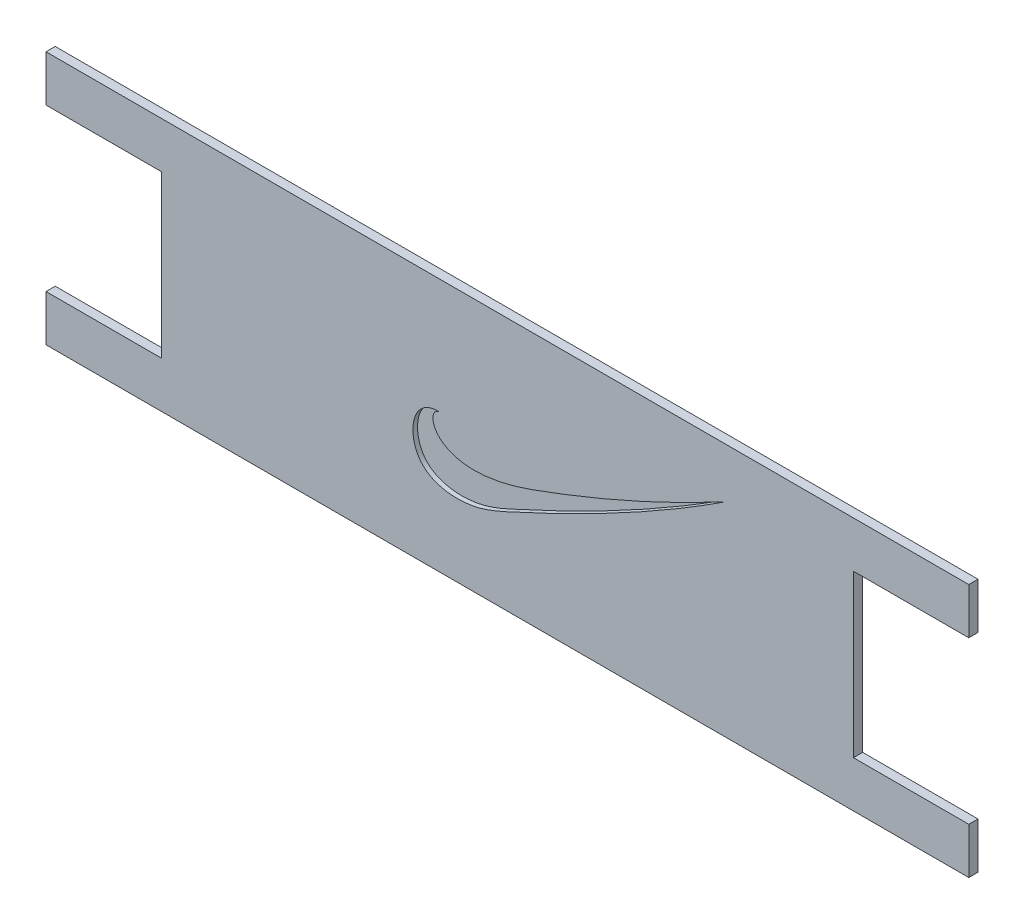
ISO-10303-21;
HEADER;
FILE_DESCRIPTION(('STEP AP214'),'2;1');
FILE_NAME('part.step','',(''),(''),'','','');
FILE_SCHEMA(('AUTOMOTIVE_DESIGN { 1 0 10303 214 1 1 1 1 }'));
ENDSEC;
DATA;
#1=APPLICATION_CONTEXT('core data for automotive mechanical design processes');
#2=APPLICATION_PROTOCOL_DEFINITION('international standard','automotive_design',2000,#1);
#3=PRODUCT_CONTEXT('',#1,'mechanical');
#4=PRODUCT('Part','Part','',(#3));
#5=PRODUCT_RELATED_PRODUCT_CATEGORY('part','',(#4));
#6=PRODUCT_DEFINITION_FORMATION('','',#4);
#7=PRODUCT_DEFINITION_CONTEXT('part definition',#1,'design');
#8=PRODUCT_DEFINITION('design','',#6,#7);
#9=PRODUCT_DEFINITION_SHAPE('','',#8);
#10=(LENGTH_UNIT() NAMED_UNIT(*) SI_UNIT(.MILLI.,.METRE.));
#11=(NAMED_UNIT(*) PLANE_ANGLE_UNIT() SI_UNIT($,.RADIAN.));
#12=(NAMED_UNIT(*) SI_UNIT($,.STERADIAN.) SOLID_ANGLE_UNIT());
#13=UNCERTAINTY_MEASURE_WITH_UNIT(LENGTH_MEASURE(1.E-05),#10,'distance_accuracy_value','');
#14=(GEOMETRIC_REPRESENTATION_CONTEXT(3) GLOBAL_UNCERTAINTY_ASSIGNED_CONTEXT((#13)) GLOBAL_UNIT_ASSIGNED_CONTEXT((#10,
#11,#12)) REPRESENTATION_CONTEXT('',''));
#15=CARTESIAN_POINT('',(0.,0.,0.));
#16=DIRECTION('',(0.,0.,1.));
#17=DIRECTION('',(1.,0.,0.));
#18=AXIS2_PLACEMENT_3D('',#15,#16,#17);
#19=CARTESIAN_POINT('',(1.68703785593946,0.519908743531917,1.49622110929935));
#20=DIRECTION('',(1.,0.,0.));
#21=DIRECTION('',(0.,1.,0.));
#22=AXIS2_PLACEMENT_3D('',#19,#20,#21);
#23=PLANE('',#22);
#24=DIRECTION('',(0.,-1.,0.));
#25=VECTOR('',#24,1.);
#26=CARTESIAN_POINT('',(1.68703785593946,0.519908743531917,0.496221109299349));
#27=LINE('',#26,#25);
#28=CARTESIAN_POINT('',(1.68703785593946,0.519908743531917,0.496221109299349));
#29=VERTEX_POINT('',#28);
#30=CARTESIAN_POINT('',(1.68703785593946,-4.48009125646808,0.496221109299349));
#31=VERTEX_POINT('',#30);
#32=EDGE_CURVE('E170',#29,#31,#27,.T.);
#33=ORIENTED_EDGE('',*,*,#32,.T.);
#34=DIRECTION('',(0.,0.,-1.));
#35=VECTOR('',#34,1.);
#36=CARTESIAN_POINT('',(1.68703785593946,-4.48009125646808,1.49622110929935));
#37=LINE('',#36,#35);
#38=CARTESIAN_POINT('',(1.68703785593946,-4.48009125646808,1.49622110929935));
#39=VERTEX_POINT('',#38);
#40=EDGE_CURVE('E11',#39,#31,#37,.T.);
#41=ORIENTED_EDGE('',*,*,#40,.F.);
#42=DIRECTION('',(0.,-1.,0.));
#43=VECTOR('',#42,1.);
#44=CARTESIAN_POINT('',(1.68703785593946,0.519908743531917,1.49622110929935));
#45=LINE('',#44,#43);
#46=CARTESIAN_POINT('',(1.68703785593946,0.519908743531917,1.49622110929935));
#47=VERTEX_POINT('',#46);
#48=EDGE_CURVE('E194',#47,#39,#45,.T.);
#49=ORIENTED_EDGE('',*,*,#48,.F.);
#50=DIRECTION('',(0.,0.,-1.));
#51=VECTOR('',#50,1.);
#52=CARTESIAN_POINT('',(1.68703785593946,0.519908743531917,1.49622110929935));
#53=LINE('',#52,#51);
#54=EDGE_CURVE('E166',#47,#29,#53,.T.);
#55=ORIENTED_EDGE('',*,*,#54,.T.);
#56=EDGE_LOOP('',(#33,#41,#49,#55));
#57=FACE_BOUND('',#56,.T.);
#58=ADVANCED_FACE('F38',(#57),#23,.F.);
#59=CARTESIAN_POINT('',(14.1870378559395,-4.48009125646808,1.49622110929935));
#60=DIRECTION('',(0.,1.,0.));
#61=DIRECTION('',(-1.,0.,0.));
#62=AXIS2_PLACEMENT_3D('',#59,#60,#61);
#63=PLANE('',#62);
#64=DIRECTION('',(1.,0.,0.));
#65=VECTOR('',#64,1.);
#66=CARTESIAN_POINT('',(14.1870378559395,-4.48009125646808,0.496221109299349));
#67=LINE('',#66,#65);
#68=CARTESIAN_POINT('',(14.1870378559395,-4.48009125646808,0.496221109299349));
#69=VERTEX_POINT('',#68);
#70=EDGE_CURVE('E173',#31,#69,#67,.T.);
#71=ORIENTED_EDGE('',*,*,#70,.T.);
#72=DIRECTION('',(0.,0.,-1.));
#73=VECTOR('',#72,1.);
#74=CARTESIAN_POINT('',(14.1870378559395,-4.48009125646808,1.49622110929935));
#75=LINE('',#74,#73);
#76=CARTESIAN_POINT('',(14.1870378559395,-4.48009125646808,1.49622110929935));
#77=VERTEX_POINT('',#76);
#78=EDGE_CURVE('E45',#77,#69,#75,.T.);
#79=ORIENTED_EDGE('',*,*,#78,.F.);
#80=DIRECTION('',(1.,0.,0.));
#81=VECTOR('',#80,1.);
#82=CARTESIAN_POINT('',(14.1870378559395,-4.48009125646808,1.49622110929935));
#83=LINE('',#82,#81);
#84=EDGE_CURVE('E114',#39,#77,#83,.T.);
#85=ORIENTED_EDGE('',*,*,#84,.F.);
#86=ORIENTED_EDGE('',*,*,#40,.T.);
#87=EDGE_LOOP('',(#71,#79,#85,#86));
#88=FACE_BOUND('',#87,.T.);
#89=ADVANCED_FACE('F333',(#88),#63,.F.);
#90=CARTESIAN_POINT('',(14.1870378559395,-4.48009125646808,1.49622110929935));
#91=DIRECTION('',(1.,0.,0.));
#92=DIRECTION('',(0.,0.,-1.));
#93=AXIS2_PLACEMENT_3D('',#90,#91,#92);
#94=PLANE('',#93);
#95=DIRECTION('',(0.,-1.,0.));
#96=VECTOR('',#95,1.);
#97=CARTESIAN_POINT('',(14.1870378559395,-4.48009125646808,0.496221109299349));
#98=LINE('',#97,#96);
#99=CARTESIAN_POINT('',(14.1870378559395,-21.9800912564681,0.496221109299349));
#100=VERTEX_POINT('',#99);
#101=EDGE_CURVE('E176',#69,#100,#98,.T.);
#102=ORIENTED_EDGE('',*,*,#101,.T.);
#103=DIRECTION('',(0.,0.,-1.));
#104=VECTOR('',#103,1.);
#105=CARTESIAN_POINT('',(14.1870378559395,-21.9800912564681,1.49622110929935));
#106=LINE('',#105,#104);
#107=CARTESIAN_POINT('',(14.1870378559395,-21.9800912564681,1.49622110929935));
#108=VERTEX_POINT('',#107);
#109=EDGE_CURVE('E213',#108,#100,#106,.T.);
#110=ORIENTED_EDGE('',*,*,#109,.F.);
#111=DIRECTION('',(0.,-1.,0.));
#112=VECTOR('',#111,1.);
#113=CARTESIAN_POINT('',(14.1870378559395,-4.48009125646808,1.49622110929935));
#114=LINE('',#113,#112);
#115=EDGE_CURVE('E221',#77,#108,#114,.T.);
#116=ORIENTED_EDGE('',*,*,#115,.F.);
#117=ORIENTED_EDGE('',*,*,#78,.T.);
#118=EDGE_LOOP('',(#102,#110,#116,#117));
#119=FACE_BOUND('',#118,.T.);
#120=ADVANCED_FACE('F219',(#119),#94,.F.);
#121=CARTESIAN_POINT('',(1.68703785593946,-21.9800912564681,1.49622110929935));
#122=DIRECTION('',(0.,-1.,0.));
#123=DIRECTION('',(0.,0.,-1.));
#124=AXIS2_PLACEMENT_3D('',#121,#122,#123);
#125=PLANE('',#124);
#126=DIRECTION('',(-1.,0.,0.));
#127=VECTOR('',#126,1.);
#128=CARTESIAN_POINT('',(1.68703785593946,-21.9800912564681,0.496221109299349));
#129=LINE('',#128,#127);
#130=CARTESIAN_POINT('',(1.68703785593946,-21.9800912564681,0.496221109299349));
#131=VERTEX_POINT('',#130);
#132=EDGE_CURVE('E178',#100,#131,#129,.T.);
#133=ORIENTED_EDGE('',*,*,#132,.T.);
#134=DIRECTION('',(0.,0.,-1.));
#135=VECTOR('',#134,1.);
#136=CARTESIAN_POINT('',(1.68703785593946,-21.9800912564681,1.49622110929935));
#137=LINE('',#136,#135);
#138=CARTESIAN_POINT('',(1.68703785593946,-21.9800912564681,1.49622110929935));
#139=VERTEX_POINT('',#138);
#140=EDGE_CURVE('E210',#139,#131,#137,.T.);
#141=ORIENTED_EDGE('',*,*,#140,.F.);
#142=DIRECTION('',(-1.,0.,0.));
#143=VECTOR('',#142,1.);
#144=CARTESIAN_POINT('',(1.68703785593946,-21.9800912564681,1.49622110929935));
#145=LINE('',#144,#143);
#146=EDGE_CURVE('E239',#108,#139,#145,.T.);
#147=ORIENTED_EDGE('',*,*,#146,.F.);
#148=ORIENTED_EDGE('',*,*,#109,.T.);
#149=EDGE_LOOP('',(#133,#141,#147,#148));
#150=FACE_BOUND('',#149,.T.);
#151=ADVANCED_FACE('F230',(#150),#125,.F.);
#152=CARTESIAN_POINT('',(1.68703785593946,-21.9800912564681,1.49622110929935));
#153=DIRECTION('',(1.,0.,0.));
#154=DIRECTION('',(0.,0.,-1.));
#155=AXIS2_PLACEMENT_3D('',#152,#153,#154);
#156=PLANE('',#155);
#157=DIRECTION('',(0.,-1.,0.));
#158=VECTOR('',#157,1.);
#159=CARTESIAN_POINT('',(1.68703785593946,-21.9800912564681,0.496221109299349));
#160=LINE('',#159,#158);
#161=CARTESIAN_POINT('',(1.68703785593946,-26.9800912564681,0.496221109299349));
#162=VERTEX_POINT('',#161);
#163=EDGE_CURVE('E180',#131,#162,#160,.T.);
#164=ORIENTED_EDGE('',*,*,#163,.T.);
#165=DIRECTION('',(0.,0.,-1.));
#166=VECTOR('',#165,1.);
#167=CARTESIAN_POINT('',(1.68703785593946,-26.9800912564681,1.49622110929935));
#168=LINE('',#167,#166);
#169=CARTESIAN_POINT('',(1.68703785593946,-26.9800912564681,1.49622110929935));
#170=VERTEX_POINT('',#169);
#171=EDGE_CURVE('E207',#170,#162,#168,.T.);
#172=ORIENTED_EDGE('',*,*,#171,.F.);
#173=DIRECTION('',(0.,-1.,0.));
#174=VECTOR('',#173,1.);
#175=CARTESIAN_POINT('',(1.68703785593946,-21.9800912564681,1.49622110929935));
#176=LINE('',#175,#174);
#177=EDGE_CURVE('E236',#139,#170,#176,.T.);
#178=ORIENTED_EDGE('',*,*,#177,.F.);
#179=ORIENTED_EDGE('',*,*,#140,.T.);
#180=EDGE_LOOP('',(#164,#172,#178,#179));
#181=FACE_BOUND('',#180,.T.);
#182=ADVANCED_FACE('F234',(#181),#156,.F.);
#183=CARTESIAN_POINT('',(1.68703785593946,-26.9800912564681,1.49622110929935));
#184=DIRECTION('',(0.,1.,0.));
#185=DIRECTION('',(0.,0.,1.));
#186=AXIS2_PLACEMENT_3D('',#183,#184,#185);
#187=PLANE('',#186);
#188=DIRECTION('',(1.,0.,0.));
#189=VECTOR('',#188,1.);
#190=CARTESIAN_POINT('',(1.68703785593946,-26.9800912564681,0.496221109299349));
#191=LINE('',#190,#189);
#192=CARTESIAN_POINT('',(101.687037855939,-26.9800912564681,0.496221109299349));
#193=VERTEX_POINT('',#192);
#194=EDGE_CURVE('E182',#162,#193,#191,.T.);
#195=ORIENTED_EDGE('',*,*,#194,.T.);
#196=DIRECTION('',(0.,0.,-1.));
#197=VECTOR('',#196,1.);
#198=CARTESIAN_POINT('',(101.687037855939,-26.9800912564681,1.49622110929935));
#199=LINE('',#198,#197);
#200=CARTESIAN_POINT('',(101.687037855939,-26.9800912564681,1.49622110929935));
#201=VERTEX_POINT('',#200);
#202=EDGE_CURVE('E204',#201,#193,#199,.T.);
#203=ORIENTED_EDGE('',*,*,#202,.F.);
#204=DIRECTION('',(1.,0.,0.));
#205=VECTOR('',#204,1.);
#206=CARTESIAN_POINT('',(1.68703785593946,-26.9800912564681,1.49622110929935));
#207=LINE('',#206,#205);
#208=EDGE_CURVE('E238',#170,#201,#207,.T.);
#209=ORIENTED_EDGE('',*,*,#208,.F.);
#210=ORIENTED_EDGE('',*,*,#171,.T.);
#211=EDGE_LOOP('',(#195,#203,#209,#210));
#212=FACE_BOUND('',#211,.T.);
#213=ADVANCED_FACE('F323',(#212),#187,.F.);
#214=CARTESIAN_POINT('',(101.687037855939,-21.9800912564681,1.49622110929935));
#215=DIRECTION('',(-1.,0.,0.));
#216=DIRECTION('',(0.,0.,1.));
#217=AXIS2_PLACEMENT_3D('',#214,#215,#216);
#218=PLANE('',#217);
#219=DIRECTION('',(0.,1.,0.));
#220=VECTOR('',#219,1.);
#221=CARTESIAN_POINT('',(101.687037855939,-21.9800912564681,0.496221109299349));
#222=LINE('',#221,#220);
#223=CARTESIAN_POINT('',(101.687037855939,-21.9800912564681,0.496221109299349));
#224=VERTEX_POINT('',#223);
#225=EDGE_CURVE('E184',#193,#224,#222,.T.);
#226=ORIENTED_EDGE('',*,*,#225,.T.);
#227=DIRECTION('',(0.,0.,-1.));
#228=VECTOR('',#227,1.);
#229=CARTESIAN_POINT('',(101.687037855939,-21.9800912564681,1.49622110929935));
#230=LINE('',#229,#228);
#231=CARTESIAN_POINT('',(101.687037855939,-21.9800912564681,1.49622110929935));
#232=VERTEX_POINT('',#231);
#233=EDGE_CURVE('E201',#232,#224,#230,.T.);
#234=ORIENTED_EDGE('',*,*,#233,.F.);
#235=DIRECTION('',(0.,1.,0.));
#236=VECTOR('',#235,1.);
#237=CARTESIAN_POINT('',(101.687037855939,-21.9800912564681,1.49622110929935));
#238=LINE('',#237,#236);
#239=EDGE_CURVE('E241',#201,#232,#238,.T.);
#240=ORIENTED_EDGE('',*,*,#239,.F.);
#241=ORIENTED_EDGE('',*,*,#202,.T.);
#242=EDGE_LOOP('',(#226,#234,#240,#241));
#243=FACE_BOUND('',#242,.T.);
#244=ADVANCED_FACE('F320',(#243),#218,.F.);
#245=CARTESIAN_POINT('',(89.1870378559395,-21.9800912564681,1.49622110929935));
#246=DIRECTION('',(0.,-1.,0.));
#247=DIRECTION('',(0.,0.,-1.));
#248=AXIS2_PLACEMENT_3D('',#245,#246,#247);
#249=PLANE('',#248);
#250=DIRECTION('',(-1.,0.,0.));
#251=VECTOR('',#250,1.);
#252=CARTESIAN_POINT('',(89.1870378559395,-21.9800912564681,0.496221109299349));
#253=LINE('',#252,#251);
#254=CARTESIAN_POINT('',(89.1870378559395,-21.9800912564681,0.496221109299349));
#255=VERTEX_POINT('',#254);
#256=EDGE_CURVE('E186',#224,#255,#253,.T.);
#257=ORIENTED_EDGE('',*,*,#256,.T.);
#258=DIRECTION('',(0.,0.,-1.));
#259=VECTOR('',#258,1.);
#260=CARTESIAN_POINT('',(89.1870378559395,-21.9800912564681,1.49622110929935));
#261=LINE('',#260,#259);
#262=CARTESIAN_POINT('',(89.1870378559395,-21.9800912564681,1.49622110929935));
#263=VERTEX_POINT('',#262);
#264=EDGE_CURVE('E198',#263,#255,#261,.T.);
#265=ORIENTED_EDGE('',*,*,#264,.F.);
#266=DIRECTION('',(-1.,0.,0.));
#267=VECTOR('',#266,1.);
#268=CARTESIAN_POINT('',(89.1870378559395,-21.9800912564681,1.49622110929935));
#269=LINE('',#268,#267);
#270=EDGE_CURVE('E247',#232,#263,#269,.T.);
#271=ORIENTED_EDGE('',*,*,#270,.F.);
#272=ORIENTED_EDGE('',*,*,#233,.T.);
#273=EDGE_LOOP('',(#257,#265,#271,#272));
#274=FACE_BOUND('',#273,.T.);
#275=ADVANCED_FACE('F253',(#274),#249,.F.);
#276=CARTESIAN_POINT('',(89.1870378559395,-4.48009125646808,1.49622110929935));
#277=DIRECTION('',(-1.,0.,0.));
#278=DIRECTION('',(0.,0.,1.));
#279=AXIS2_PLACEMENT_3D('',#276,#277,#278);
#280=PLANE('',#279);
#281=DIRECTION('',(0.,1.,0.));
#282=VECTOR('',#281,1.);
#283=CARTESIAN_POINT('',(89.1870378559395,-4.48009125646808,0.496221109299349));
#284=LINE('',#283,#282);
#285=CARTESIAN_POINT('',(89.1870378559395,-4.48009125646808,0.496221109299349));
#286=VERTEX_POINT('',#285);
#287=EDGE_CURVE('E188',#255,#286,#284,.T.);
#288=ORIENTED_EDGE('',*,*,#287,.T.);
#289=DIRECTION('',(0.,0.,-1.));
#290=VECTOR('',#289,1.);
#291=CARTESIAN_POINT('',(89.1870378559395,-4.48009125646808,1.49622110929935));
#292=LINE('',#291,#290);
#293=CARTESIAN_POINT('',(89.1870378559395,-4.48009125646808,1.49622110929935));
#294=VERTEX_POINT('',#293);
#295=EDGE_CURVE('E161',#294,#286,#292,.T.);
#296=ORIENTED_EDGE('',*,*,#295,.F.);
#297=DIRECTION('',(0.,1.,0.));
#298=VECTOR('',#297,1.);
#299=CARTESIAN_POINT('',(89.1870378559395,-4.48009125646808,1.49622110929935));
#300=LINE('',#299,#298);
#301=EDGE_CURVE('E149',#263,#294,#300,.T.);
#302=ORIENTED_EDGE('',*,*,#301,.F.);
#303=ORIENTED_EDGE('',*,*,#264,.T.);
#304=EDGE_LOOP('',(#288,#296,#302,#303));
#305=FACE_BOUND('',#304,.T.);
#306=ADVANCED_FACE('F257',(#305),#280,.F.);
#307=CARTESIAN_POINT('',(89.1870378559395,-4.48009125646808,1.49622110929935));
#308=DIRECTION('',(0.,1.,0.));
#309=DIRECTION('',(0.,0.,1.));
#310=AXIS2_PLACEMENT_3D('',#307,#308,#309);
#311=PLANE('',#310);
#312=DIRECTION('',(1.,0.,0.));
#313=VECTOR('',#312,1.);
#314=CARTESIAN_POINT('',(89.1870378559395,-4.48009125646808,0.496221109299349));
#315=LINE('',#314,#313);
#316=CARTESIAN_POINT('',(101.687037855939,-4.48009125646808,0.496221109299349));
#317=VERTEX_POINT('',#316);
#318=EDGE_CURVE('E158',#286,#317,#315,.T.);
#319=ORIENTED_EDGE('',*,*,#318,.T.);
#320=DIRECTION('',(0.,0.,-1.));
#321=VECTOR('',#320,1.);
#322=CARTESIAN_POINT('',(101.687037855939,-4.48009125646808,1.49622110929935));
#323=LINE('',#322,#321);
#324=CARTESIAN_POINT('',(101.687037855939,-4.48009125646808,1.49622110929935));
#325=VERTEX_POINT('',#324);
#326=EDGE_CURVE('E155',#325,#317,#323,.T.);
#327=ORIENTED_EDGE('',*,*,#326,.F.);
#328=DIRECTION('',(1.,0.,0.));
#329=VECTOR('',#328,1.);
#330=CARTESIAN_POINT('',(89.1870378559395,-4.48009125646808,1.49622110929935));
#331=LINE('',#330,#329);
#332=EDGE_CURVE('E142',#294,#325,#331,.T.);
#333=ORIENTED_EDGE('',*,*,#332,.F.);
#334=ORIENTED_EDGE('',*,*,#295,.T.);
#335=EDGE_LOOP('',(#319,#327,#333,#334));
#336=FACE_BOUND('',#335,.T.);
#337=ADVANCED_FACE('F156',(#336),#311,.F.);
#338=CARTESIAN_POINT('',(101.687037855939,0.519908743531917,1.49622110929935));
#339=DIRECTION('',(-1.,0.,0.));
#340=DIRECTION('',(0.,0.,1.));
#341=AXIS2_PLACEMENT_3D('',#338,#339,#340);
#342=PLANE('',#341);
#343=DIRECTION('',(0.,1.,0.));
#344=VECTOR('',#343,1.);
#345=CARTESIAN_POINT('',(101.687037855939,0.519908743531917,0.496221109299349));
#346=LINE('',#345,#344);
#347=CARTESIAN_POINT('',(101.687037855939,0.519908743531917,0.496221109299349));
#348=VERTEX_POINT('',#347);
#349=EDGE_CURVE('E191',#317,#348,#346,.T.);
#350=ORIENTED_EDGE('',*,*,#349,.T.);
#351=DIRECTION('',(0.,0.,-1.));
#352=VECTOR('',#351,1.);
#353=CARTESIAN_POINT('',(101.687037855939,0.519908743531917,1.49622110929935));
#354=LINE('',#353,#352);
#355=CARTESIAN_POINT('',(101.687037855939,0.519908743531917,1.49622110929935));
#356=VERTEX_POINT('',#355);
#357=EDGE_CURVE('E162',#356,#348,#354,.T.);
#358=ORIENTED_EDGE('',*,*,#357,.F.);
#359=DIRECTION('',(0.,1.,0.));
#360=VECTOR('',#359,1.);
#361=CARTESIAN_POINT('',(101.687037855939,0.519908743531917,1.49622110929935));
#362=LINE('',#361,#360);
#363=EDGE_CURVE('E146',#325,#356,#362,.T.);
#364=ORIENTED_EDGE('',*,*,#363,.F.);
#365=ORIENTED_EDGE('',*,*,#326,.T.);
#366=EDGE_LOOP('',(#350,#358,#364,#365));
#367=FACE_BOUND('',#366,.T.);
#368=ADVANCED_FACE('F164',(#367),#342,.F.);
#369=CARTESIAN_POINT('',(1.68703785593946,0.519908743531917,1.49622110929935));
#370=DIRECTION('',(0.,-1.,0.));
#371=DIRECTION('',(0.,0.,-1.));
#372=AXIS2_PLACEMENT_3D('',#369,#370,#371);
#373=PLANE('',#372);
#374=DIRECTION('',(-1.,0.,0.));
#375=VECTOR('',#374,1.);
#376=CARTESIAN_POINT('',(1.68703785593946,0.519908743531917,0.496221109299349));
#377=LINE('',#376,#375);
#378=EDGE_CURVE('E106',#348,#29,#377,.T.);
#379=ORIENTED_EDGE('',*,*,#378,.T.);
#380=ORIENTED_EDGE('',*,*,#54,.F.);
#381=DIRECTION('',(-1.,0.,0.));
#382=VECTOR('',#381,1.);
#383=CARTESIAN_POINT('',(1.68703785593946,0.519908743531917,1.49622110929935));
#384=LINE('',#383,#382);
#385=EDGE_CURVE('E61',#356,#47,#384,.T.);
#386=ORIENTED_EDGE('',*,*,#385,.F.);
#387=ORIENTED_EDGE('',*,*,#357,.T.);
#388=EDGE_LOOP('',(#379,#380,#386,#387));
#389=FACE_BOUND('',#388,.T.);
#390=ADVANCED_FACE('F258',(#389),#373,.F.);
#391=CARTESIAN_POINT('',(25.8424432613448,-6.60207835717579,1.49622110929935));
#392=DIRECTION('',(0.,0.,-1.));
#393=DIRECTION('',(-1.,0.,0.));
#394=AXIS2_PLACEMENT_3D('',#391,#392,#393);
#395=PLANE('',#394);
#396=CARTESIAN_POINT('',(75.2691262584783,-4.9333568905543,1.49622110929935));
#397=CARTESIAN_POINT('',(69.6748920548865,-7.89957137834894,1.49622110929935));
#398=CARTESIAN_POINT('',(62.9524672773362,-11.1252073032552,1.49622110929935));
#399=CARTESIAN_POINT('',(43.4927571471915,-18.2103123106615,1.49622110929935));
#400=CARTESIAN_POINT('',(42.5795267376545,-11.914178068081,1.49622110929935));
#401=CARTESIAN_POINT('',(44.4371856733208,-11.9612257004064,1.49622110929935));
#402=B_SPLINE_CURVE_WITH_KNOTS('',3,(#396,#397,#398,#399,#400,#401),.UNSPECIFIED.,.F.,.F.,(4,1,
1,4),(0.,0.40738033918613,0.482234890207092,1.),.UNSPECIFIED.);
#403=CARTESIAN_POINT('',(75.2691262584783,-4.9333568905543,1.49622110929935));
#404=VERTEX_POINT('',#403);
#405=CARTESIAN_POINT('',(44.4371856733208,-11.9612257004064,1.49622110929935));
#406=VERTEX_POINT('',#405);
#407=EDGE_CURVE('E269',#404,#406,#402,.T.);
#408=ORIENTED_EDGE('',*,*,#407,.F.);
#409=CARTESIAN_POINT('',(44.4371856733208,-11.9612257004064,1.49622110929935));
#410=CARTESIAN_POINT('',(41.2504154927812,-11.7684509099057,1.49622110929935));
#411=CARTESIAN_POINT('',(40.4208807672569,-18.6870048510555,1.49622110929935));
#412=CARTESIAN_POINT('',(47.4675364785836,-19.5287156020687,1.49622110929935));
#413=CARTESIAN_POINT('',(58.4375242043421,-14.6915373787783,1.49622110929935));
#414=CARTESIAN_POINT('',(67.8406955708347,-9.79446268544349,1.49622110929935));
#415=CARTESIAN_POINT('',(75.2691262584783,-4.9333568905543,1.49622110929935));
#416=B_SPLINE_CURVE_WITH_KNOTS('',3,(#409,#410,#411,#412,#413,#414,#415),.UNSPECIFIED.,.F.,.F.,
(4,1,1,1,4),(0.,0.163170519365482,0.2917639299808,0.388322167502561,1.),.UNSPECIFIED.);
#417=EDGE_CURVE('E52',#406,#404,#416,.T.);
#418=ORIENTED_EDGE('',*,*,#417,.F.);
#419=EDGE_LOOP('',(#408,#418));
#420=FACE_BOUND('',#419,.T.);
#421=ORIENTED_EDGE('',*,*,#48,.T.);
#422=ORIENTED_EDGE('',*,*,#84,.T.);
#423=ORIENTED_EDGE('',*,*,#115,.T.);
#424=ORIENTED_EDGE('',*,*,#146,.T.);
#425=ORIENTED_EDGE('',*,*,#177,.T.);
#426=ORIENTED_EDGE('',*,*,#208,.T.);
#427=ORIENTED_EDGE('',*,*,#239,.T.);
#428=ORIENTED_EDGE('',*,*,#270,.T.);
#429=ORIENTED_EDGE('',*,*,#301,.T.);
#430=ORIENTED_EDGE('',*,*,#332,.T.);
#431=ORIENTED_EDGE('',*,*,#363,.T.);
#432=ORIENTED_EDGE('',*,*,#385,.T.);
#433=EDGE_LOOP('',(#421,#422,#423,#424,#425,#426,#427,#428,#429,#430,#431,#432));
#434=FACE_BOUND('',#433,.T.);
#435=ADVANCED_FACE('F144',(#420,#434),#395,.F.);
#436=CARTESIAN_POINT('',(25.8424432613448,-6.60207835717579,0.496221109299349));
#437=DIRECTION('',(0.,0.,-1.));
#438=DIRECTION('',(-1.,0.,0.));
#439=AXIS2_PLACEMENT_3D('',#436,#437,#438);
#440=PLANE('',#439);
#441=ORIENTED_EDGE('',*,*,#32,.F.);
#442=ORIENTED_EDGE('',*,*,#378,.F.);
#443=ORIENTED_EDGE('',*,*,#349,.F.);
#444=ORIENTED_EDGE('',*,*,#318,.F.);
#445=ORIENTED_EDGE('',*,*,#287,.F.);
#446=ORIENTED_EDGE('',*,*,#256,.F.);
#447=ORIENTED_EDGE('',*,*,#225,.F.);
#448=ORIENTED_EDGE('',*,*,#194,.F.);
#449=ORIENTED_EDGE('',*,*,#163,.F.);
#450=ORIENTED_EDGE('',*,*,#132,.F.);
#451=ORIENTED_EDGE('',*,*,#101,.F.);
#452=ORIENTED_EDGE('',*,*,#70,.F.);
#453=EDGE_LOOP('',(#441,#442,#443,#444,#445,#446,#447,#448,#449,#450,#451,#452));
#454=FACE_BOUND('',#453,.T.);
#455=ADVANCED_FACE('F225',(#454),#440,.T.);
#456=CARTESIAN_POINT('',(44.4371856733208,-11.9612257004064,0.996221109299349));
#457=CARTESIAN_POINT('',(41.2504154927812,-11.7684509099057,0.996221109299349));
#458=CARTESIAN_POINT('',(40.4208807672569,-18.6870048510555,0.996221109299349));
#459=CARTESIAN_POINT('',(47.4675364785836,-19.5287156020687,0.996221109299349));
#460=CARTESIAN_POINT('',(58.4375242043421,-14.6915373787783,0.996221109299349));
#461=CARTESIAN_POINT('',(67.8406955708347,-9.79446268544349,0.996221109299349));
#462=CARTESIAN_POINT('',(75.2691262584783,-4.9333568905543,0.996221109299349));
#463=B_SPLINE_CURVE_WITH_KNOTS('',3,(#456,#457,#458,#459,#460,#461,#462),.UNSPECIFIED.,.F.,.F.,
(4,1,1,1,4),(0.,0.163170519365482,0.2917639299808,0.388322167502561,1.),.UNSPECIFIED.);
#464=DIRECTION('',(0.,0.,1.));
#465=VECTOR('',#464,1.);
#466=SURFACE_OF_LINEAR_EXTRUSION('',#463,#465);
#467=ORIENTED_EDGE('',*,*,#417,.T.);
#468=DIRECTION('',(0.,0.,1.));
#469=VECTOR('',#468,1.);
#470=CARTESIAN_POINT('',(75.2691262584783,-4.9333568905543,0.996221109299349));
#471=LINE('',#470,#469);
#472=CARTESIAN_POINT('',(75.2691262584783,-4.9333568905543,0.996221109299349));
#473=VERTEX_POINT('',#472);
#474=EDGE_CURVE('E265',#473,#404,#471,.T.);
#475=ORIENTED_EDGE('',*,*,#474,.F.);
#476=CARTESIAN_POINT('',(44.4371856733208,-11.9612257004064,0.996221109299349));
#477=VERTEX_POINT('',#476);
#478=EDGE_CURVE('E274',#477,#473,#463,.T.);
#479=ORIENTED_EDGE('',*,*,#478,.F.);
#480=DIRECTION('',(0.,0.,1.));
#481=VECTOR('',#480,1.);
#482=CARTESIAN_POINT('',(44.4371856733208,-11.9612257004064,0.996221109299349));
#483=LINE('',#482,#481);
#484=EDGE_CURVE('E174',#477,#406,#483,.T.);
#485=ORIENTED_EDGE('',*,*,#484,.T.);
#486=EDGE_LOOP('',(#467,#475,#479,#485));
#487=FACE_BOUND('',#486,.T.);
#488=ADVANCED_FACE('F301',(#487),#466,.F.);
#489=CARTESIAN_POINT('',(75.2691262584783,-4.9333568905543,0.996221109299349));
#490=CARTESIAN_POINT('',(69.6748920548865,-7.89957137834894,0.996221109299349));
#491=CARTESIAN_POINT('',(62.9524672773362,-11.1252073032552,0.996221109299349));
#492=CARTESIAN_POINT('',(43.4927571471915,-18.2103123106615,0.996221109299349));
#493=CARTESIAN_POINT('',(42.5795267376545,-11.914178068081,0.996221109299349));
#494=CARTESIAN_POINT('',(44.4371856733208,-11.9612257004064,0.996221109299349));
#495=B_SPLINE_CURVE_WITH_KNOTS('',3,(#489,#490,#491,#492,#493,#494),.UNSPECIFIED.,.F.,.F.,(4,1,
1,4),(0.,0.40738033918613,0.482234890207092,1.),.UNSPECIFIED.);
#496=DIRECTION('',(0.,0.,1.));
#497=VECTOR('',#496,1.);
#498=SURFACE_OF_LINEAR_EXTRUSION('',#495,#497);
#499=ORIENTED_EDGE('',*,*,#407,.T.);
#500=ORIENTED_EDGE('',*,*,#484,.F.);
#501=EDGE_CURVE('E267',#473,#477,#495,.T.);
#502=ORIENTED_EDGE('',*,*,#501,.F.);
#503=ORIENTED_EDGE('',*,*,#474,.T.);
#504=EDGE_LOOP('',(#499,#500,#502,#503));
#505=FACE_BOUND('',#504,.T.);
#506=ADVANCED_FACE('F296',(#505),#498,.F.);
#507=CARTESIAN_POINT('',(56.0907714337042,-15.6056556220081,0.996221109299349));
#508=DIRECTION('',(0.,0.,-1.));
#509=DIRECTION('',(-1.,0.,0.));
#510=AXIS2_PLACEMENT_3D('',#507,#508,#509);
#511=PLANE('',#510);
#512=ORIENTED_EDGE('',*,*,#478,.T.);
#513=ORIENTED_EDGE('',*,*,#501,.T.);
#514=EDGE_LOOP('',(#512,#513));
#515=FACE_BOUND('',#514,.T.);
#516=ADVANCED_FACE('F300',(#515),#511,.F.);
#517=CLOSED_SHELL('',(#58,#89,#120,#151,#182,#213,#244,#275,#306,#337,#368,#390,#435,#455,#488,
#506,#516));
#518=MANIFOLD_SOLID_BREP('B2',#517);
#519=ADVANCED_BREP_SHAPE_REPRESENTATION('',(#18,#518),#14);
#520=SHAPE_DEFINITION_REPRESENTATION(#9,#519);
ENDSEC;
END-ISO-10303-21;
